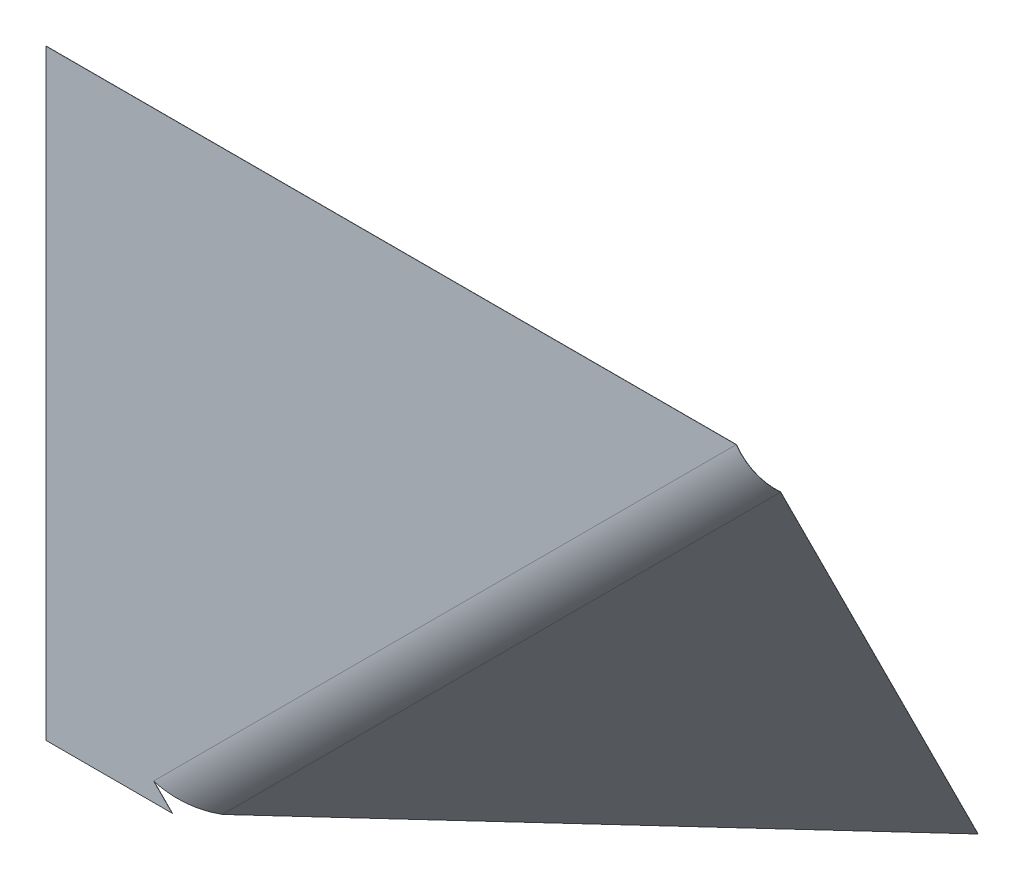
ISO-10303-21;
HEADER;
FILE_DESCRIPTION(('STEP AP214'),'2;1');
FILE_NAME('part.step','',(''),(''),'','','');
FILE_SCHEMA(('AUTOMOTIVE_DESIGN { 1 0 10303 214 1 1 1 1 }'));
ENDSEC;
DATA;
#1=APPLICATION_CONTEXT('core data for automotive mechanical design processes');
#2=APPLICATION_PROTOCOL_DEFINITION('international standard','automotive_design',2000,#1);
#3=PRODUCT_CONTEXT('',#1,'mechanical');
#4=PRODUCT('Part','Part','',(#3));
#5=PRODUCT_RELATED_PRODUCT_CATEGORY('part','',(#4));
#6=PRODUCT_DEFINITION_FORMATION('','',#4);
#7=PRODUCT_DEFINITION_CONTEXT('part definition',#1,'design');
#8=PRODUCT_DEFINITION('design','',#6,#7);
#9=PRODUCT_DEFINITION_SHAPE('','',#8);
#10=(LENGTH_UNIT() NAMED_UNIT(*) SI_UNIT(.MILLI.,.METRE.));
#11=(NAMED_UNIT(*) PLANE_ANGLE_UNIT() SI_UNIT($,.RADIAN.));
#12=(NAMED_UNIT(*) SI_UNIT($,.STERADIAN.) SOLID_ANGLE_UNIT());
#13=UNCERTAINTY_MEASURE_WITH_UNIT(LENGTH_MEASURE(1.E-05),#10,'distance_accuracy_value','');
#14=(GEOMETRIC_REPRESENTATION_CONTEXT(3) GLOBAL_UNCERTAINTY_ASSIGNED_CONTEXT((#13)) GLOBAL_UNIT_ASSIGNED_CONTEXT((#10,
#11,#12)) REPRESENTATION_CONTEXT('',''));
#15=CARTESIAN_POINT('',(0.,0.,0.));
#16=DIRECTION('',(0.,0.,1.));
#17=DIRECTION('',(1.,0.,0.));
#18=AXIS2_PLACEMENT_3D('',#15,#16,#17);
#19=CARTESIAN_POINT('',(0.,0.,-0.0762));
#20=DIRECTION('',(0.,0.,1.));
#21=DIRECTION('',(1.,0.,0.));
#22=AXIS2_PLACEMENT_3D('',#19,#20,#21);
#23=PLANE('',#22);
#24=DIRECTION('',(-0.70710678118655,0.707106781186545,-1.28196245894167E-13));
#25=VECTOR('',#24,1.);
#26=CARTESIAN_POINT('',(53.3528286100641,-127.,-0.0762000000000222));
#27=LINE('',#26,#25);
#28=CARTESIAN_POINT('',(53.3528286100641,-127.,-0.0762000000000222));
#29=VERTEX_POINT('',#28);
#30=CARTESIAN_POINT('',(45.4651664643095,-119.112337854245,-0.0762000000014522));
#31=VERTEX_POINT('',#30);
#32=EDGE_CURVE('E13',#29,#31,#27,.T.);
#33=ORIENTED_EDGE('',*,*,#32,.F.);
#34=DIRECTION('',(1.,0.,0.));
#35=VECTOR('',#34,1.);
#36=CARTESIAN_POINT('',(0.,-127.,-0.0762));
#37=LINE('',#36,#35);
#38=CARTESIAN_POINT('',(0.,-127.,-0.0762));
#39=VERTEX_POINT('',#38);
#40=EDGE_CURVE('E113',#39,#29,#37,.T.);
#41=ORIENTED_EDGE('',*,*,#40,.F.);
#42=DIRECTION('',(0.,-1.,0.));
#43=VECTOR('',#42,1.);
#44=CARTESIAN_POINT('',(0.,127.,-0.0762));
#45=LINE('',#44,#43);
#46=CARTESIAN_POINT('',(0.,127.,-0.0762));
#47=VERTEX_POINT('',#46);
#48=EDGE_CURVE('E125',#47,#39,#45,.T.);
#49=ORIENTED_EDGE('',*,*,#48,.F.);
#50=DIRECTION('',(-1.,0.,0.));
#51=VECTOR('',#50,1.);
#52=CARTESIAN_POINT('',(0.,127.,-0.0762));
#53=LINE('',#52,#51);
#54=CARTESIAN_POINT('',(291.577504318555,127.,-0.0762000000002164));
#55=VERTEX_POINT('',#54);
#56=EDGE_CURVE('E129',#55,#47,#53,.T.);
#57=ORIENTED_EDGE('',*,*,#56,.F.);
#58=DIRECTION('',(-0.707106781186548,-0.707106781186548,0.));
#59=VECTOR('',#58,1.);
#60=CARTESIAN_POINT('',(45.4651664643095,-119.112337854246,-0.0762000000014557));
#61=LINE('',#60,#59);
#62=EDGE_CURVE('E146',#31,#55,#61,.F.);
#63=ORIENTED_EDGE('',*,*,#62,.F.);
#64=EDGE_LOOP('',(#33,#41,#49,#57,#63));
#65=FACE_BOUND('',#64,.T.);
#66=ADVANCED_FACE('F54',(#65),#23,.F.);
#67=CARTESIAN_POINT('',(0.,0.,0.));
#68=DIRECTION('',(0.,0.,1.));
#69=DIRECTION('',(1.,0.,0.));
#70=AXIS2_PLACEMENT_3D('',#67,#68,#69);
#71=PLANE('',#70);
#72=DIRECTION('',(1.,0.,0.));
#73=VECTOR('',#72,1.);
#74=CARTESIAN_POINT('',(0.,-127.,0.));
#75=LINE('',#74,#73);
#76=CARTESIAN_POINT('',(0.,-127.,0.));
#77=VERTEX_POINT('',#76);
#78=CARTESIAN_POINT('',(53.3528286100641,-127.,0.));
#79=VERTEX_POINT('',#78);
#80=EDGE_CURVE('E105',#77,#79,#75,.T.);
#81=ORIENTED_EDGE('',*,*,#80,.T.);
#82=DIRECTION('',(-0.70710678118655,0.707106781186545,0.));
#83=VECTOR('',#82,1.);
#84=CARTESIAN_POINT('',(-36.8235856949682,-36.8235856949684,0.));
#85=LINE('',#84,#83);
#86=CARTESIAN_POINT('',(45.4651664643095,-119.112337854245,-1.45369827286856E-12));
#87=VERTEX_POINT('',#86);
#88=EDGE_CURVE('E96',#79,#87,#85,.T.);
#89=ORIENTED_EDGE('',*,*,#88,.T.);
#90=DIRECTION('',(-0.707106781186548,-0.707106781186548,0.));
#91=VECTOR('',#90,1.);
#92=CARTESIAN_POINT('',(45.4651664643095,-119.112337854246,-1.45716771982052E-12));
#93=LINE('',#92,#91);
#94=CARTESIAN_POINT('',(291.577504318552,127.,0.));
#95=VERTEX_POINT('',#94);
#96=EDGE_CURVE('E179',#87,#95,#93,.F.);
#97=ORIENTED_EDGE('',*,*,#96,.T.);
#98=DIRECTION('',(-1.,0.,0.));
#99=VECTOR('',#98,1.);
#100=CARTESIAN_POINT('',(0.,127.,0.));
#101=LINE('',#100,#99);
#102=CARTESIAN_POINT('',(0.,127.,0.));
#103=VERTEX_POINT('',#102);
#104=EDGE_CURVE('E58',#95,#103,#101,.T.);
#105=ORIENTED_EDGE('',*,*,#104,.T.);
#106=DIRECTION('',(0.,-1.,0.));
#107=VECTOR('',#106,1.);
#108=CARTESIAN_POINT('',(0.,127.,0.));
#109=LINE('',#108,#107);
#110=EDGE_CURVE('E117',#103,#77,#109,.T.);
#111=ORIENTED_EDGE('',*,*,#110,.T.);
#112=EDGE_LOOP('',(#81,#89,#97,#105,#111));
#113=FACE_BOUND('',#112,.T.);
#114=ADVANCED_FACE('F115',(#113),#71,.T.);
#115=CARTESIAN_POINT('',(0.,127.,-0.0762));
#116=DIRECTION('',(-1.,0.,0.));
#117=DIRECTION('',(0.,0.,1.));
#118=AXIS2_PLACEMENT_3D('',#115,#116,#117);
#119=PLANE('',#118);
#120=ORIENTED_EDGE('',*,*,#110,.F.);
#121=DIRECTION('',(0.,0.,1.));
#122=VECTOR('',#121,1.);
#123=CARTESIAN_POINT('',(0.,127.,-0.0762));
#124=LINE('',#123,#122);
#125=EDGE_CURVE('E123',#47,#103,#124,.T.);
#126=ORIENTED_EDGE('',*,*,#125,.F.);
#127=ORIENTED_EDGE('',*,*,#48,.T.);
#128=DIRECTION('',(0.,0.,1.));
#129=VECTOR('',#128,1.);
#130=CARTESIAN_POINT('',(0.,-127.,-0.0762));
#131=LINE('',#130,#129);
#132=EDGE_CURVE('E128',#39,#77,#131,.T.);
#133=ORIENTED_EDGE('',*,*,#132,.T.);
#134=EDGE_LOOP('',(#120,#126,#127,#133));
#135=FACE_BOUND('',#134,.T.);
#136=ADVANCED_FACE('F257',(#135),#119,.T.);
#137=CARTESIAN_POINT('',(0.,127.,-0.0762));
#138=DIRECTION('',(0.,1.,0.));
#139=DIRECTION('',(0.,0.,1.));
#140=AXIS2_PLACEMENT_3D('',#137,#138,#139);
#141=PLANE('',#140);
#142=DIRECTION('',(0.,0.,1.));
#143=VECTOR('',#142,1.);
#144=CARTESIAN_POINT('',(291.577504318555,127.,-0.0762000000002191));
#145=LINE('',#144,#143);
#146=EDGE_CURVE('E118',#55,#95,#145,.T.);
#147=ORIENTED_EDGE('',*,*,#146,.F.);
#148=ORIENTED_EDGE('',*,*,#56,.T.);
#149=ORIENTED_EDGE('',*,*,#125,.T.);
#150=ORIENTED_EDGE('',*,*,#104,.F.);
#151=EDGE_LOOP('',(#147,#148,#149,#150));
#152=FACE_BOUND('',#151,.T.);
#153=ADVANCED_FACE('F56',(#152),#141,.T.);
#154=CARTESIAN_POINT('',(0.,-127.,-0.0762));
#155=DIRECTION('',(0.,-1.,0.));
#156=DIRECTION('',(1.,0.,0.));
#157=AXIS2_PLACEMENT_3D('',#154,#155,#156);
#158=PLANE('',#157);
#159=ORIENTED_EDGE('',*,*,#80,.F.);
#160=ORIENTED_EDGE('',*,*,#132,.F.);
#161=ORIENTED_EDGE('',*,*,#40,.T.);
#162=DIRECTION('',(0.,0.,1.));
#163=VECTOR('',#162,1.);
#164=CARTESIAN_POINT('',(53.3528286100641,-127.,-0.0762));
#165=LINE('',#164,#163);
#166=EDGE_CURVE('E64',#29,#79,#165,.T.);
#167=ORIENTED_EDGE('',*,*,#166,.T.);
#168=EDGE_LOOP('',(#159,#160,#161,#167));
#169=FACE_BOUND('',#168,.T.);
#170=ADVANCED_FACE('F110',(#169),#158,.T.);
#171=CARTESIAN_POINT('',(53.3528286100641,-127.,-0.0762000000000222));
#172=DIRECTION('',(0.707106781186545,0.70710678118655,0.));
#173=DIRECTION('',(-0.70710678118655,0.707106781186545,0.));
#174=AXIS2_PLACEMENT_3D('',#171,#172,#173);
#175=PLANE('',#174);
#176=ORIENTED_EDGE('',*,*,#88,.F.);
#177=ORIENTED_EDGE('',*,*,#166,.F.);
#178=ORIENTED_EDGE('',*,*,#32,.T.);
#179=DIRECTION('',(0.,0.,1.));
#180=VECTOR('',#179,1.);
#181=CARTESIAN_POINT('',(45.4651664643095,-119.112337854246,-0.0762000000014557));
#182=LINE('',#181,#180);
#183=EDGE_CURVE('E101',#31,#87,#182,.T.);
#184=ORIENTED_EDGE('',*,*,#183,.T.);
#185=EDGE_LOOP('',(#176,#177,#178,#184));
#186=FACE_BOUND('',#185,.T.);
#187=ADVANCED_FACE('F98',(#186),#175,.T.);
#188=CARTESIAN_POINT('',(291.577504318554,127.,0.00076199999977946));
#189=CARTESIAN_POINT('',(292.608980205279,125.555748122513,0.000761999999795034));
#190=CARTESIAN_POINT('',(293.640402715203,124.11155873333,-0.171651267559936));
#191=CARTESIAN_POINT('',(295.655761830378,121.270656748134,-0.854695482231287));
#192=CARTESIAN_POINT('',(296.63962701106,119.874020132442,-1.36530953972868));
#193=CARTESIAN_POINT('',(298.514104541144,117.173999732337,-2.7051489629572));
#194=CARTESIAN_POINT('',(299.404660333808,115.870672504661,-3.53434119851829));
#195=CARTESIAN_POINT('',(301.050358583776,113.399431384672,-5.47948655265991));
#196=CARTESIAN_POINT('',(301.805442758649,112.231580330541,-6.59537791155504));
#197=CARTESIAN_POINT('',(302.47435670849,111.149890389937,-7.83324179366102));
#198=CARTESIAN_POINT('',(291.577504318554,127.,-2.20540274410708E-13));
#199=CARTESIAN_POINT('',(292.608944939489,125.55578338831,-2.04966732219066E-13));
#200=CARTESIAN_POINT('',(293.640332185308,124.111629263225,-0.172408355640971));
#201=CARTESIAN_POINT('',(295.655622124946,121.270796453566,-0.855433110917586));
#202=CARTESIAN_POINT('',(296.639453396311,119.87419374719,-1.36603262142038));
#203=CARTESIAN_POINT('',(298.513865764464,117.174238509017,-2.70583387367305));
#204=CARTESIAN_POINT('',(299.404390306124,115.870942532346,-3.53500248619675));
#205=CARTESIAN_POINT('',(301.050029911902,113.399760056546,-5.48009242467061));
#206=CARTESIAN_POINT('',(301.805086695327,112.231936393856,-6.59595199271593));
#207=CARTESIAN_POINT('',(302.47397570849,111.150271389937,-7.83378060902828));
#208=CARTESIAN_POINT('',(291.577504318554,127.,-0.0762000000002205));
#209=CARTESIAN_POINT('',(292.605418360479,125.559309968025,-0.076200000000205));
#210=CARTESIAN_POINT('',(293.633279195844,124.118682252689,-0.248117163744559));
#211=CARTESIAN_POINT('',(295.641651581708,121.284766996804,-0.929195979547451));
#212=CARTESIAN_POINT('',(296.622091921481,119.89155522202,-1.43834079059012));
#213=CARTESIAN_POINT('',(298.489988096462,117.198116177018,-2.77432494525803));
#214=CARTESIAN_POINT('',(299.377387537669,115.897945300801,-3.60113125404234));
#215=CARTESIAN_POINT('',(301.017162724528,113.43262724392,-5.54067962573992));
#216=CARTESIAN_POINT('',(301.769480363156,112.267542725321,-6.65336010880507));
#217=CARTESIAN_POINT('',(302.43587570849,111.188371389937,-7.8876621457547));
#218=CARTESIAN_POINT('',(291.577504318554,127.,-0.0769696200002205));
#219=CARTESIAN_POINT('',(292.605382742031,125.55934558648,-0.076969620000205));
#220=CARTESIAN_POINT('',(293.633207960651,124.118753487882,-0.248881822706405));
#221=CARTESIAN_POINT('',(295.641510479221,121.28490809929,-0.929940984520612));
#222=CARTESIAN_POINT('',(296.621916570586,119.891730572916,-1.43907110309874));
#223=CARTESIAN_POINT('',(298.489746932015,117.198357341465,-2.77501670508104));
#224=CARTESIAN_POINT('',(299.377114809707,115.898218028762,-3.60179915459758));
#225=CARTESIAN_POINT('',(301.016830765935,113.432959202513,-5.54129155647072));
#226=CARTESIAN_POINT('',(301.769120739201,112.267902349269,-6.65393993077757));
#227=CARTESIAN_POINT('',(302.43549089849,111.188756199937,-7.88820634927564));
#228=B_SPLINE_SURFACE_WITH_KNOTS('',1,3,((#188,#189,#190,#191,#192,#193,#194,#195,#196,#197),
(#198,#199,#200,#201,#202,#203,#204,#205,#206,#207),(#208,#209,#210,#211,#212,#213,#214,#215,
#216,#217),(#218,#219,#220,#221,#222,#223,#224,#225,#226,#227)),.UNSPECIFIED.,.F.,.F.,.F.,(2,1,
1,2),(4,2,2,2,4),(-0.01,0.,1.,1.0101),(0.,0.25,0.5,0.75,1.),.UNSPECIFIED.);
#229=DIRECTION('',(0.499999999999998,-0.499999999999997,0.707106781186551));
#230=VECTOR('',#229,1.);
#231=CARTESIAN_POINT('',(302.47397570849,111.150271389937,-7.83378060902831));
#232=LINE('',#231,#230);
#233=CARTESIAN_POINT('',(302.43587570849,111.188371389937,-7.88766214575471));
#234=VERTEX_POINT('',#233);
#235=CARTESIAN_POINT('',(302.47397570849,111.150271389937,-7.8337806090283));
#236=VERTEX_POINT('',#235);
#237=EDGE_CURVE('E198',#234,#236,#232,.T.);
#238=CARTESIAN_POINT('',(291.577504318554,127.,-0.0762000000002205));
#239=CARTESIAN_POINT('',(291.83448030485,126.639831154951,-0.0761907431426537));
#240=CARTESIAN_POINT('',(292.091455734181,126.279662866868,-0.0869102152724209));
#241=CARTESIAN_POINT('',(292.604663514116,125.560069369427,-0.129740150744093));
#242=CARTESIAN_POINT('',(292.860895864721,125.200644160069,-0.161850614085996));
#243=CARTESIAN_POINT('',(293.371875522411,124.483278784875,-0.247396065219409));
#244=CARTESIAN_POINT('',(293.626622829495,124.125338619038,-0.300831053010918));
#245=CARTESIAN_POINT('',(294.133894492615,123.411681238413,-0.428893905468015));
#246=CARTESIAN_POINT('',(294.386418848651,123.055964023624,-0.503521770133603));
#247=CARTESIAN_POINT('',(294.888511928901,122.347485225868,-0.673791373158402));
#248=CARTESIAN_POINT('',(295.138080653116,121.994723642901,-0.76943311151761));
#249=CARTESIAN_POINT('',(295.633536943777,121.292881634735,-0.981499843085712));
#250=CARTESIAN_POINT('',(295.879424510223,120.943801209536,-1.09792483629461));
#251=CARTESIAN_POINT('',(296.366801818359,120.250038183895,-1.35127765574964));
#252=CARTESIAN_POINT('',(296.608291560048,119.905355583453,-1.48820548199579));
#253=CARTESIAN_POINT('',(297.086167149071,119.221094276925,-1.78223408114211));
#254=CARTESIAN_POINT('',(297.322552996406,118.881515570837,-1.93933485404228));
#255=CARTESIAN_POINT('',(297.789527021538,118.2081558282,-2.27333088180588));
#256=CARTESIAN_POINT('',(298.020115199335,117.87437479165,-2.45022613666931));
#257=CARTESIAN_POINT('',(298.474814079912,117.213290193568,-2.82338496812638));
#258=CARTESIAN_POINT('',(298.698924782691,116.885986632036,-3.01964854472002));
#259=CARTESIAN_POINT('',(299.140004503439,116.238521193783,-3.43107121493882));
#260=CARTESIAN_POINT('',(299.356973521408,115.918359317062,-3.64623030856399));
#261=CARTESIAN_POINT('',(299.783122901541,115.285824219423,-4.09492563402158));
#262=CARTESIAN_POINT('',(299.992303263706,114.973450998506,-4.32846186585401));
#263=CARTESIAN_POINT('',(300.402246998491,114.357121546215,-4.81334901392824));
#264=CARTESIAN_POINT('',(300.603010371112,114.053165314841,-5.06469993017004));
#265=CARTESIAN_POINT('',(300.995512541678,113.45427742677,-5.58461034065236));
#266=CARTESIAN_POINT('',(301.187251339623,113.159345770072,-5.85316983489288));
#267=CARTESIAN_POINT('',(301.561116757632,112.579094634559,-6.40685258273866));
#268=CARTESIAN_POINT('',(301.743243377696,112.293775155742,-6.69197583634392));
#269=CARTESIAN_POINT('',(302.097326558223,111.733306257709,-7.27809113722247));
#270=CARTESIAN_POINT('',(302.269283118687,111.458156838493,-7.57908318449576));
#271=CARTESIAN_POINT('',(302.43587570849,111.188371389937,-7.8876621457547));
#272=B_SPLINE_CURVE_WITH_KNOTS('',3,(#238,#239,#240,#241,#242,#243,#244,#245,#246,#247,#248,
#249,#250,#251,#252,#253,#254,#255,#256,#257,#258,#259,#260,#261,#262,#263,#264,#265,#266,#267,
#268,#269,#270,#271),.UNSPECIFIED.,.F.,.F.,(4,2,2,2,2,2,2,2,2,2,2,2,2,2,2,2,4),(0.,
1.32720635512662,2.65441271025318,3.98161906537974,5.30882542050637,6.63603177563293,
7.96323813075948,9.29044448588608,10.6176508410126,11.9448571961392,13.2720635512658,
14.5992699063924,15.926476261519,17.2536826166456,18.5808889717722,19.9080953268987,
21.2353016820253),.UNSPECIFIED.);
#273=EDGE_CURVE('E173',#55,#234,#272,.T.);
#274=CARTESIAN_POINT('',(291.577504318554,127.,-2.22044604925031E-13));
#275=CARTESIAN_POINT('',(291.835361940323,126.638949519478,9.28330550746043E-06));
#276=CARTESIAN_POINT('',(292.093219003536,126.277899597513,-0.0107408158874873));
#277=CARTESIAN_POINT('',(292.608187928154,125.55654495539,-0.0536931226033623));
#278=CARTESIAN_POINT('',(292.865299789559,125.196240235232,-0.0858953301262421));
#279=CARTESIAN_POINT('',(293.378034225866,124.477120081419,-0.171685196834322));
#280=CARTESIAN_POINT('',(293.633656800769,124.118304647764,-0.225272856019522));
#281=CARTESIAN_POINT('',(294.142672648237,123.40290308279,-0.353701602340785));
#282=CARTESIAN_POINT('',(294.396065920803,123.046316951472,-0.428542689476848));
#283=CARTESIAN_POINT('',(294.899888389451,122.336108765319,-0.599298777081715));
#284=CARTESIAN_POINT('',(295.150317585532,121.982486710485,-0.695213777550519));
#285=CARTESIAN_POINT('',(295.647484302335,121.278934276177,-0.907886414065955));
#286=CARTESIAN_POINT('',(295.894221823055,120.929003896704,-1.02464405011259));
#287=CARTESIAN_POINT('',(296.383286474524,120.23355352773,-1.27872073476607));
#288=CARTESIAN_POINT('',(296.625613605273,119.888033538228,-1.41603978337292));
#289=CARTESIAN_POINT('',(297.105149389862,119.202112036134,-1.71090846423109));
#290=CARTESIAN_POINT('',(297.342358043701,118.861710523542,-1.8684580964824));
#291=CARTESIAN_POINT('',(297.810961117073,118.186721732665,-2.20340839861104));
#292=CARTESIAN_POINT('',(298.042355536605,117.85213445438,-2.38080906848836));
#293=CARTESIAN_POINT('',(298.49864839358,117.1894558799,-2.75503406803531));
#294=CARTESIAN_POINT('',(298.723546831023,116.861364583705,-2.95185839770494));
#295=CARTESIAN_POINT('',(299.166181616283,116.212344080939,-3.36445656126722));
#296=CARTESIAN_POINT('',(299.383917964102,115.891414874368,-3.58023039515988));
#297=CARTESIAN_POINT('',(299.811579750632,115.257367370332,-4.03020770726164));
#298=CARTESIAN_POINT('',(300.021505189344,114.944249072868,-4.26441118547074));
#299=CARTESIAN_POINT('',(300.432915028682,114.326453516024,-4.75068372539661));
#300=CARTESIAN_POINT('',(300.634399429309,114.021776256644,-5.00275278711338));
#301=CARTESIAN_POINT('',(301.028317871388,113.421472097061,-5.52414865591136));
#302=CARTESIAN_POINT('',(301.220751912839,113.125845196857,-5.79347546299258));
#303=CARTESIAN_POINT('',(301.595980354495,112.544231037695,-6.34874016154649));
#304=CARTESIAN_POINT('',(301.7787747547,112.258243778737,-6.63467805301918));
#305=CARTESIAN_POINT('',(302.134164438197,111.696468377735,-7.22246796904309));
#306=CARTESIAN_POINT('',(302.306759721489,111.420680235691,-7.5243199935943));
#307=CARTESIAN_POINT('',(302.47397570849,111.150271389937,-7.83378060902828));
#308=B_SPLINE_CURVE_WITH_KNOTS('',3,(#274,#275,#276,#277,#278,#279,#280,#281,#282,#283,#284,
#285,#286,#287,#288,#289,#290,#291,#292,#293,#294,#295,#296,#297,#298,#299,#300,#301,#302,#303,
#304,#305,#306,#307),.UNSPECIFIED.,.F.,.F.,(4,2,2,2,2,2,2,2,2,2,2,2,2,2,2,2,4),(0.,
1.33089535767913,2.66179071535823,3.99268607303729,5.32358143071642,6.65447678839553,
7.98537214607462,9.31626750375372,10.6471628614328,11.9780582191119,13.308953576791,
14.6398489344701,15.9707442921492,17.3016396498283,18.6325350075075,19.9634303651866,
21.2943257228656),.UNSPECIFIED.);
#309=EDGE_CURVE('E72',#95,#236,#308,.T.);
#310=ORIENTED_EDGE('',*,*,#237,.F.);
#311=ORIENTED_EDGE('',*,*,#273,.F.);
#312=ORIENTED_EDGE('',*,*,#146,.T.);
#313=ORIENTED_EDGE('',*,*,#309,.T.);
#314=EDGE_LOOP('',(#310,#311,#312,#313));
#315=FACE_BOUND('',#314,.T.);
#316=ADVANCED_FACE('F168',(#315),#228,.F.);
#317=CARTESIAN_POINT('',(66.6501096100639,-124.67435670849,-7.83324179366222));
#318=CARTESIAN_POINT('',(65.1238485838811,-124.450017609134,-6.59538057374801));
#319=CARTESIAN_POINT('',(63.5114296927131,-124.139497506391,-5.47948655266118));
#320=CARTESIAN_POINT('',(60.1510496501089,-123.382938179038,-3.53434119851959));
#321=CARTESIAN_POINT('',(58.4031529611261,-122.936951847681,-2.70514896295852));
#322=CARTESIAN_POINT('',(54.8139936384058,-121.951613240213,-1.36530953973));
#323=CARTESIAN_POINT('',(52.9727875614062,-121.412317520839,-0.854695482232609));
#324=CARTESIAN_POINT('',(49.2427466535944,-120.286097328279,-0.17165126756123));
#325=CARTESIAN_POINT('',(47.3539886476373,-119.699238110746,0.000761999998527589));
#326=CARTESIAN_POINT('',(45.4651664643095,-119.112337854245,0.000761999998544337));
#327=CARTESIAN_POINT('',(66.6497286100639,-124.67397570849,-7.83378060902948));
#328=CARTESIAN_POINT('',(65.123492520662,-124.449661545772,-6.59595465494778));
#329=CARTESIAN_POINT('',(63.5111010208393,-124.139168834517,-5.48009242467187));
#330=CARTESIAN_POINT('',(60.1507796224243,-123.382668151354,-3.53500248619805));
#331=CARTESIAN_POINT('',(58.4029141844461,-122.936713071001,-2.70583387367437));
#332=CARTESIAN_POINT('',(54.8138200236575,-121.951439625464,-1.3660326214217));
#333=CARTESIAN_POINT('',(52.9726478559738,-121.412177815406,-0.855433110918908));
#334=CARTESIAN_POINT('',(49.2426761236998,-120.286026798384,-0.172408355642266));
#335=CARTESIAN_POINT('',(47.3539533817332,-119.699202844985,-1.47241068641166E-12));
#336=CARTESIAN_POINT('',(45.4651664643095,-119.112337854245,-1.45566338930619E-12));
#337=CARTESIAN_POINT('',(66.6116286100639,-124.63587570849,-7.8876621457559));
#338=CARTESIAN_POINT('',(65.0878861987554,-124.41405520954,-6.65336277492478));
#339=CARTESIAN_POINT('',(63.478233833465,-124.106301647143,-5.54067962574118));
#340=CARTESIAN_POINT('',(60.1237768539696,-123.355665382899,-3.60113125404364));
#341=CARTESIAN_POINT('',(58.3790365164448,-122.912835403,-2.77432494525934));
#342=CARTESIAN_POINT('',(54.7964585488276,-121.934078150634,-1.43834079059144));
#343=CARTESIAN_POINT('',(52.9586773127362,-121.398207272169,-0.929195979548772));
#344=CARTESIAN_POINT('',(49.2356231342361,-120.27897380892,-0.248117163745853));
#345=CARTESIAN_POINT('',(47.3504267913202,-119.695676268897,-0.0762000000014724));
#346=CARTESIAN_POINT('',(45.4651664643095,-119.112337854245,-0.0762000000014557));
#347=CARTESIAN_POINT('',(66.6112438000639,-124.63549089849,-7.88820634927683));
#348=CARTESIAN_POINT('',(65.0875265749041,-124.413695585544,-6.65394259693655));
#349=CARTESIAN_POINT('',(63.4779018748725,-124.10596968855,-5.54129155647199));
#350=CARTESIAN_POINT('',(60.1235041260082,-123.355392654937,-3.60179915459888));
#351=CARTESIAN_POINT('',(58.378795351998,-122.912594238553,-2.77501670508235));
#352=CARTESIAN_POINT('',(54.7962831979318,-121.933902799739,-1.43907110310006));
#353=CARTESIAN_POINT('',(52.9585362102495,-121.398066169682,-0.929940984521934));
#354=CARTESIAN_POINT('',(49.2355518990425,-120.278902573727,-0.248881822707699));
#355=CARTESIAN_POINT('',(47.350391172757,-119.695640650479,-0.0769696200014724));
#356=CARTESIAN_POINT('',(45.4651664643095,-119.112337854245,-0.0769696200014557));
#357=B_SPLINE_SURFACE_WITH_KNOTS('',1,3,((#317,#318,#319,#320,#321,#322,#323,#324,#325,#326),
(#327,#328,#329,#330,#331,#332,#333,#334,#335,#336),(#337,#338,#339,#340,#341,#342,#343,#344,
#345,#346),(#347,#348,#349,#350,#351,#352,#353,#354,#355,#356)),.UNSPECIFIED.,.F.,.F.,.F.,(2,1,
1,2),(4,2,2,2,4),(-0.01,0.,1.,1.0101),(0.,0.25,0.5,0.75,1.),.UNSPECIFIED.);
#358=CARTESIAN_POINT('',(66.6116286100639,-124.63587570849,-7.8876621457559));
#359=CARTESIAN_POINT('',(66.571927631521,-124.630096191805,-7.85550258998756));
#360=CARTESIAN_POINT('',(66.532168517644,-124.624258526453,-7.8234253224659));
#361=CARTESIAN_POINT('',(66.3330773064449,-124.594779972243,-7.66344734299352));
#362=CARTESIAN_POINT('',(66.1728765600356,-124.570271046561,-7.53678654999709));
#363=CARTESIAN_POINT('',(65.6894992349132,-124.494014905559,-7.16081140595959));
#364=CARTESIAN_POINT('',(65.3635862881761,-124.439543682972,-6.91553642648462));
#365=CARTESIAN_POINT('',(64.8695659872573,-124.352641973202,-6.55607118059356));
#366=CARTESIAN_POINT('',(64.7040444070884,-124.322810917442,-6.43766432191467));
#367=CARTESIAN_POINT('',(64.3713048297564,-124.261455264743,-6.2036994554224));
#368=CARTESIAN_POINT('',(64.2040868325933,-124.229930667804,-6.08814144760913));
#369=CARTESIAN_POINT('',(63.8680033286524,-124.165231029656,-5.8599277638221));
#370=CARTESIAN_POINT('',(63.6991378218746,-124.132055988447,-5.7472720878483));
#371=CARTESIAN_POINT('',(63.1900686526796,-124.030105527884,-5.41368812978491));
#372=CARTESIAN_POINT('',(62.8474332646886,-123.958912334407,-5.19717170213456));
#373=CARTESIAN_POINT('',(62.3289665364924,-123.847565767186,-4.88154803649513));
#374=CARTESIAN_POINT('',(62.1554028278317,-123.809693250166,-4.77787140284741));
#375=CARTESIAN_POINT('',(61.8067946721017,-123.732469424901,-4.57359734100684));
#376=CARTESIAN_POINT('',(61.6317502250322,-123.693118116655,-4.47299991281409));
#377=CARTESIAN_POINT('',(61.2802280167156,-123.612982507364,-4.27492856613749));
#378=CARTESIAN_POINT('',(61.1037502554685,-123.572198206319,-4.17745464765352));
#379=CARTESIAN_POINT('',(60.7494101223303,-123.489242554842,-3.98567222732146));
#380=CARTESIAN_POINT('',(60.5715477504392,-123.447071204411,-3.89136372547347));
#381=CARTESIAN_POINT('',(60.0358865378987,-123.318529366332,-3.61321253553269));
#382=CARTESIAN_POINT('',(59.6760568344898,-123.23014096507,-3.43416853152854));
#383=CARTESIAN_POINT('',(59.1326252983506,-123.093827870573,-3.17547000351653));
#384=CARTESIAN_POINT('',(58.9508782422348,-123.047771369576,-3.09088663700383));
#385=CARTESIAN_POINT('',(58.5861811250911,-122.954457738805,-2.92503234354602));
#386=CARTESIAN_POINT('',(58.4032310640633,-122.907200609032,-2.84376141660079));
#387=CARTESIAN_POINT('',(58.0361789663465,-122.811534614234,-2.68456779354836));
#388=CARTESIAN_POINT('',(57.8520769296576,-122.76312574921,-2.60664509744092));
#389=CARTESIAN_POINT('',(57.4827727205349,-122.665205908973,-2.45418141798821));
#390=CARTESIAN_POINT('',(57.297570548101,-122.61569493376,-2.37964043464271));
#391=CARTESIAN_POINT('',(56.7403188413138,-122.465563307317,-2.16111114053731));
#392=CARTESIAN_POINT('',(56.3666692620605,-122.363355739052,-2.02223607095273));
#393=CARTESIAN_POINT('',(55.8033903369673,-122.207196872766,-1.82435913095281));
#394=CARTESIAN_POINT('',(55.6151749258319,-122.154672648084,-1.76014305530496));
#395=CARTESIAN_POINT('',(55.2378371512963,-122.048719196732,-1.63520652105171));
#396=CARTESIAN_POINT('',(55.048714787896,-121.995289970063,-1.57448606244653));
#397=CARTESIAN_POINT('',(54.6696168703244,-121.88757809538,-1.45656763486803));
#398=CARTESIAN_POINT('',(54.479641316153,-121.833295447366,-1.39936966589498));
#399=CARTESIAN_POINT('',(54.0988913507084,-121.723928936238,-1.28852068013131));
#400=CARTESIAN_POINT('',(53.9081169394352,-121.668845073124,-1.23486966334086));
#401=CARTESIAN_POINT('',(53.3346018138544,-121.50244840272,-1.07925291762059));
#402=CARTESIAN_POINT('',(52.9507158344343,-121.390003780327,-0.982638000563833));
#403=CARTESIAN_POINT('',(52.3730073363474,-121.219414750318,-0.848562287252419));
#404=CARTESIAN_POINT('',(52.1801364965724,-121.162234965082,-0.805680462688432));
#405=CARTESIAN_POINT('',(51.7937973370235,-121.047280314549,-0.723543080561322));
#406=CARTESIAN_POINT('',(51.6003290172495,-120.989505449252,-0.684287522998028));
#407=CARTESIAN_POINT('',(51.2128507232297,-120.873413732793,-0.609420173691455));
#408=CARTESIAN_POINT('',(51.0188407489838,-120.815096881632,-0.5738083819483));
#409=CARTESIAN_POINT('',(50.6303350655601,-120.697975545816,-0.506243651895919));
#410=CARTESIAN_POINT('',(50.4358393563823,-120.639171061163,-0.474290713586592));
#411=CARTESIAN_POINT('',(49.8516313941095,-120.462083219839,-0.383930392346685));
#412=CARTESIAN_POINT('',(49.4612459638732,-120.343139772531,-0.331030713685496));
#413=CARTESIAN_POINT('',(48.874742495493,-120.163755136354,-0.262775376182305));
#414=CARTESIAN_POINT('',(48.679099174335,-120.103802395437,-0.241873571100339));
#415=CARTESIAN_POINT('',(48.2875335044343,-119.983620175511,-0.203772227482096));
#416=CARTESIAN_POINT('',(48.0916111556917,-119.923390696502,-0.186572688945917));
#417=CARTESIAN_POINT('',(47.6995449973469,-119.802709953879,-0.155883763249349));
#418=CARTESIAN_POINT('',(47.5034011877448,-119.742258690266,-0.142394376088858));
#419=CARTESIAN_POINT('',(47.1109460636963,-119.621188309178,-0.119131411087366));
#420=CARTESIAN_POINT('',(46.91463474925,-119.560569191705,-0.109357833246112));
#421=CARTESIAN_POINT('',(46.3007549724691,-119.370885288649,-0.0846176988183632));
#422=CARTESIAN_POINT('',(45.88297758085,-119.241616901756,-0.0761976814999972));
#423=CARTESIAN_POINT('',(45.4651664643095,-119.112337854245,-0.0762000000014557));
#424=B_SPLINE_CURVE_WITH_KNOTS('',3,(#358,#359,#360,#361,#362,#363,#364,#365,#366,#367,#368,
#369,#370,#371,#372,#373,#374,#375,#376,#377,#378,#379,#380,#381,#382,#383,#384,#385,#386,#387,
#388,#389,#390,#391,#392,#393,#394,#395,#396,#397,#398,#399,#400,#401,#402,#403,#404,#405,#406,
#407,#408,#409,#410,#411,#412,#413,#414,#415,#416,#417,#418,#419,#420,#421,#422,#423),
.UNSPECIFIED.,.F.,.F.,(4,2,2,2,2,2,2,2,2,2,2,2,2,2,2,2,2,2,2,2,2,2,2,2,2,2,2,2,2,2,2,2,4),(0.,
0.15425373167454,0.771292351524196,2.00552131010524,2.62255993003547,3.23959854998915,
3.85663716993344,5.09086612877207,5.70790474861125,6.32494336847355,6.94198198831211,
7.55902060817015,8.79324956721356,9.41028818716766,10.0273268070992,10.6443654269857,
11.2614040468308,12.4956330053138,13.1126716251541,13.7297102450302,14.3467488649534,
14.9637874849054,16.1980164441032,16.8150550639704,17.4320936838089,18.0491323036683,
18.6661709235106,19.9003998821569,20.5174385020951,21.1344771220496,21.7515157419872,
22.3685543618826,23.6804572948236),.UNSPECIFIED.);
#425=CARTESIAN_POINT('',(66.6116286100639,-124.63587570849,-7.88766214575591));
#426=VERTEX_POINT('',#425);
#427=EDGE_CURVE('E138',#426,#31,#424,.T.);
#428=DIRECTION('',(0.499999999999998,-0.499999999999997,0.707106781186551));
#429=VECTOR('',#428,1.);
#430=CARTESIAN_POINT('',(66.6116286100646,-124.63587570849,-7.88766214575505));
#431=LINE('',#430,#429);
#432=CARTESIAN_POINT('',(66.6497286100646,-124.67397570849,-7.83378060902863));
#433=VERTEX_POINT('',#432);
#434=EDGE_CURVE('E231',#426,#433,#431,.T.);
#435=CARTESIAN_POINT('',(66.6497286100639,-124.67397570849,-7.83378060902948));
#436=CARTESIAN_POINT('',(66.6104442534335,-124.668202000497,-7.80191975777469));
#437=CARTESIAN_POINT('',(66.5711029679792,-124.662371377189,-7.77013941685963));
#438=CARTESIAN_POINT('',(66.3741071721111,-124.632934184951,-7.61163734205581));
#439=CARTESIAN_POINT('',(66.215602227126,-124.608477971711,-7.48612886755629));
#440=CARTESIAN_POINT('',(65.7372276084693,-124.532414388079,-7.11341295198275));
#441=CARTESIAN_POINT('',(65.4146780851659,-124.478137234014,-6.87016450903922));
#442=CARTESIAN_POINT('',(64.7626812577699,-124.362763298125,-6.39457155427463));
#443=CARTESIAN_POINT('',(64.4332314507383,-124.301664005644,-6.16223110174904));
#444=CARTESIAN_POINT('',(63.4272922343832,-124.107111585372,-5.47691587772821));
#445=CARTESIAN_POINT('',(62.7406621819856,-123.96359910513,-5.04146274423733));
#446=CARTESIAN_POINT('',(61.3433814752276,-123.652723600009,-4.21991730383775));
#447=CARTESIAN_POINT('',(60.6327210117968,-123.485350743586,-3.83384546926575));
#448=CARTESIAN_POINT('',(59.1890953192519,-123.129380009553,-3.11308960403691));
#449=CARTESIAN_POINT('',(58.4560887395959,-122.940740790863,-2.77850876197385));
#450=CARTESIAN_POINT('',(56.9722474012591,-122.545619926797,-2.16393799586514));
#451=CARTESIAN_POINT('',(56.2214141435458,-122.339139779752,-1.88394349392492));
#452=CARTESIAN_POINT('',(54.9226769488305,-121.97290421371,-1.45263758060399));
#453=CARTESIAN_POINT('',(54.378323812906,-121.816729400331,-1.28744943227782));
#454=CARTESIAN_POINT('',(53.2833156849793,-121.498126301711,-0.986318998267993));
#455=CARTESIAN_POINT('',(52.732660175494,-121.335697500334,-0.850379132548568));
#456=CARTESIAN_POINT('',(51.6263141925829,-121.005820751484,-0.60823517328201));
#457=CARTESIAN_POINT('',(51.0706234789782,-120.838372563697,-0.502032505987548));
#458=CARTESIAN_POINT('',(49.9559305615379,-120.499841440324,-0.319806588258298));
#459=CARTESIAN_POINT('',(49.3969315035365,-120.328761650313,-0.24375825949263));
#460=CARTESIAN_POINT('',(48.2764269784611,-119.98408521443,-0.121983271326988));
#461=CARTESIAN_POINT('',(47.7149215688117,-119.810488626019,-0.0762559207750351));
#462=CARTESIAN_POINT('',(46.590666884529,-119.462040609762,-0.0152554077176718));
#463=CARTESIAN_POINT('',(46.0279176493861,-119.28718922137,1.87081360731492E-05));
#464=CARTESIAN_POINT('',(45.4651664643095,-119.112337854245,-1.45566338930619E-12));
#465=B_SPLINE_CURVE_WITH_KNOTS('',3,(#435,#436,#437,#438,#439,#440,#441,#442,#443,#444,#445,
#446,#447,#448,#449,#450,#451,#452,#453,#454,#455,#456,#457,#458,#459,#460,#461,#462,#463,#464),
.UNSPECIFIED.,.F.,.F.,(4,2,2,2,2,2,2,2,2,2,2,2,2,2,4),(0.,0.152726458066568,0.76365521247952,
1.98621815784708,3.20923251837279,5.68377227095922,8.15933460770563,10.639795151439,
13.1200475812704,14.8890538917869,16.6582065113091,18.4274439682317,20.1952069091319,
21.9629295533488,23.7305968575692),.UNSPECIFIED.);
#466=EDGE_CURVE('E148',#433,#87,#465,.T.);
#467=ORIENTED_EDGE('',*,*,#427,.F.);
#468=ORIENTED_EDGE('',*,*,#434,.T.);
#469=ORIENTED_EDGE('',*,*,#466,.T.);
#470=ORIENTED_EDGE('',*,*,#183,.F.);
#471=EDGE_LOOP('',(#467,#468,#469,#470));
#472=FACE_BOUND('',#471,.T.);
#473=ADVANCED_FACE('F154',(#472),#357,.F.);
#474=CARTESIAN_POINT('',(45.4651664643093,-119.112337854245,-26.7462000000008));
#475=DIRECTION('',(-0.707106781186548,-0.707106781186548,0.));
#476=DIRECTION('',(0.499999999999996,-0.499999999999999,0.707106781186551));
#477=AXIS2_PLACEMENT_3D('',#474,#475,#476);
#478=CYLINDRICAL_SURFACE('',#477,26.7461999999994);
#479=ORIENTED_EDGE('',*,*,#96,.F.);
#480=ORIENTED_EDGE('',*,*,#466,.F.);
#481=DIRECTION('',(-0.707106781186546,-0.707106781186549,0.));
#482=VECTOR('',#481,1.);
#483=CARTESIAN_POINT('',(95.6618521592777,-95.6618521592772,-7.83378060902859));
#484=LINE('',#483,#482);
#485=EDGE_CURVE('E219',#236,#433,#484,.T.);
#486=ORIENTED_EDGE('',*,*,#485,.F.);
#487=ORIENTED_EDGE('',*,*,#309,.F.);
#488=EDGE_LOOP('',(#479,#480,#486,#487));
#489=FACE_BOUND('',#488,.T.);
#490=ADVANCED_FACE('F164',(#489),#478,.T.);
#491=CARTESIAN_POINT('',(45.4651664643093,-119.112337854245,-26.7462000000008));
#492=DIRECTION('',(-0.707106781186548,-0.707106781186548,0.));
#493=DIRECTION('',(0.499999999999996,-0.499999999999999,0.707106781186551));
#494=AXIS2_PLACEMENT_3D('',#491,#492,#493);
#495=CYLINDRICAL_SURFACE('',#494,26.6699999999994);
#496=ORIENTED_EDGE('',*,*,#62,.T.);
#497=ORIENTED_EDGE('',*,*,#273,.T.);
#498=DIRECTION('',(0.707106781186546,0.707106781186549,0.));
#499=VECTOR('',#498,1.);
#500=CARTESIAN_POINT('',(302.43587570849,111.188371389937,-7.8876621457547));
#501=LINE('',#500,#499);
#502=EDGE_CURVE('E213',#234,#426,#501,.F.);
#503=ORIENTED_EDGE('',*,*,#502,.T.);
#504=ORIENTED_EDGE('',*,*,#427,.T.);
#505=EDGE_LOOP('',(#496,#497,#503,#504));
#506=FACE_BOUND('',#505,.T.);
#507=ADVANCED_FACE('F160',(#506),#495,.F.);
#508=CARTESIAN_POINT('',(53.3147286100641,-126.9619,-0.022318463273607));
#509=DIRECTION('',(-0.146446609406723,-0.853553390593276,-0.499999999999997));
#510=DIRECTION('',(0.,0.505449465124421,-0.862856209461019));
#511=AXIS2_PLACEMENT_3D('',#508,#509,#510);
#512=PLANE('',#511);
#513=DIRECTION('',(-0.853553390593275,-0.146446609406726,0.499999999999998));
#514=VECTOR('',#513,1.);
#515=CARTESIAN_POINT('',(53.3147286100641,-126.9619,-0.0223184632736217));
#516=LINE('',#515,#514);
#517=CARTESIAN_POINT('',(267.938314305033,-90.1383143050321,-125.745904158241));
#518=VERTEX_POINT('',#517);
#519=EDGE_CURVE('E221',#518,#433,#516,.T.);
#520=ORIENTED_EDGE('',*,*,#519,.T.);
#521=ORIENTED_EDGE('',*,*,#434,.F.);
#522=DIRECTION('',(0.853553390593275,0.146446609406726,-0.499999999999998));
#523=VECTOR('',#522,1.);
#524=CARTESIAN_POINT('',(30.2487240442783,-130.874763797422,13.4132341816039));
#525=LINE('',#524,#523);
#526=CARTESIAN_POINT('',(267.900214305033,-90.1002143050321,-125.799785694968));
#527=VERTEX_POINT('',#526);
#528=EDGE_CURVE('E222',#527,#426,#525,.F.);
#529=ORIENTED_EDGE('',*,*,#528,.F.);
#530=DIRECTION('',(-0.499999999999998,0.499999999999997,-0.707106781186551));
#531=VECTOR('',#530,1.);
#532=CARTESIAN_POINT('',(267.938314305033,-90.1383143050321,-125.745904158241));
#533=LINE('',#532,#531);
#534=EDGE_CURVE('E147',#518,#527,#533,.T.);
#535=ORIENTED_EDGE('',*,*,#534,.F.);
#536=EDGE_LOOP('',(#520,#521,#529,#535));
#537=FACE_BOUND('',#536,.T.);
#538=ADVANCED_FACE('F163',(#537),#512,.T.);
#539=CARTESIAN_POINT('',(267.938314305033,-90.1383143050321,-125.745904158241));
#540=DIRECTION('',(0.853553390593275,0.146446609406726,-0.499999999999997));
#541=DIRECTION('',(-0.505449465124421,0.,-0.862856209461018));
#542=AXIS2_PLACEMENT_3D('',#539,#540,#541);
#543=PLANE('',#542);
#544=DIRECTION('',(0.146446609406723,0.853553390593276,0.499999999999997));
#545=VECTOR('',#544,1.);
#546=CARTESIAN_POINT('',(282.636556644907,-4.21051689176205,-75.4867658183957));
#547=LINE('',#546,#545);
#548=EDGE_CURVE('E212',#234,#527,#547,.F.);
#549=ORIENTED_EDGE('',*,*,#548,.F.);
#550=ORIENTED_EDGE('',*,*,#237,.T.);
#551=DIRECTION('',(-0.146446609406723,-0.853553390593276,-0.499999999999997));
#552=VECTOR('',#551,1.);
#553=CARTESIAN_POINT('',(267.938314305033,-90.1383143050321,-125.745904158241));
#554=LINE('',#553,#552);
#555=EDGE_CURVE('E209',#236,#518,#554,.T.);
#556=ORIENTED_EDGE('',*,*,#555,.T.);
#557=ORIENTED_EDGE('',*,*,#534,.T.);
#558=EDGE_LOOP('',(#549,#550,#556,#557));
#559=FACE_BOUND('',#558,.T.);
#560=ADVANCED_FACE('F206',(#559),#543,.T.);
#561=CARTESIAN_POINT('',(45.0231663841524,-45.0231663841522,63.7801355949021));
#562=DIRECTION('',(0.499999999999998,-0.499999999999997,0.707106781186551));
#563=DIRECTION('',(0.816496580927729,0.,-0.577350269189622));
#564=AXIS2_PLACEMENT_3D('',#561,#562,#563);
#565=PLANE('',#564);
#566=ORIENTED_EDGE('',*,*,#555,.F.);
#567=ORIENTED_EDGE('',*,*,#485,.T.);
#568=ORIENTED_EDGE('',*,*,#519,.F.);
#569=EDGE_LOOP('',(#566,#567,#568));
#570=FACE_BOUND('',#569,.T.);
#571=ADVANCED_FACE('F217',(#570),#565,.T.);
#572=CARTESIAN_POINT('',(44.9850663841524,-44.9850663841522,63.7262540581757));
#573=DIRECTION('',(0.499999999999998,-0.499999999999997,0.707106781186551));
#574=DIRECTION('',(0.816496580927729,0.,-0.577350269189622));
#575=AXIS2_PLACEMENT_3D('',#572,#573,#574);
#576=PLANE('',#575);
#577=ORIENTED_EDGE('',*,*,#502,.F.);
#578=ORIENTED_EDGE('',*,*,#548,.T.);
#579=ORIENTED_EDGE('',*,*,#528,.T.);
#580=EDGE_LOOP('',(#577,#578,#579));
#581=FACE_BOUND('',#580,.T.);
#582=ADVANCED_FACE('F244',(#581),#576,.F.);
#583=CLOSED_SHELL('',(#66,#114,#136,#153,#170,#187,#316,#473,#490,#507,#538,#560,#571,#582));
#584=MANIFOLD_SOLID_BREP('B2',#583);
#585=ADVANCED_BREP_SHAPE_REPRESENTATION('',(#18,#584),#14);
#586=SHAPE_DEFINITION_REPRESENTATION(#9,#585);
ENDSEC;
END-ISO-10303-21;
